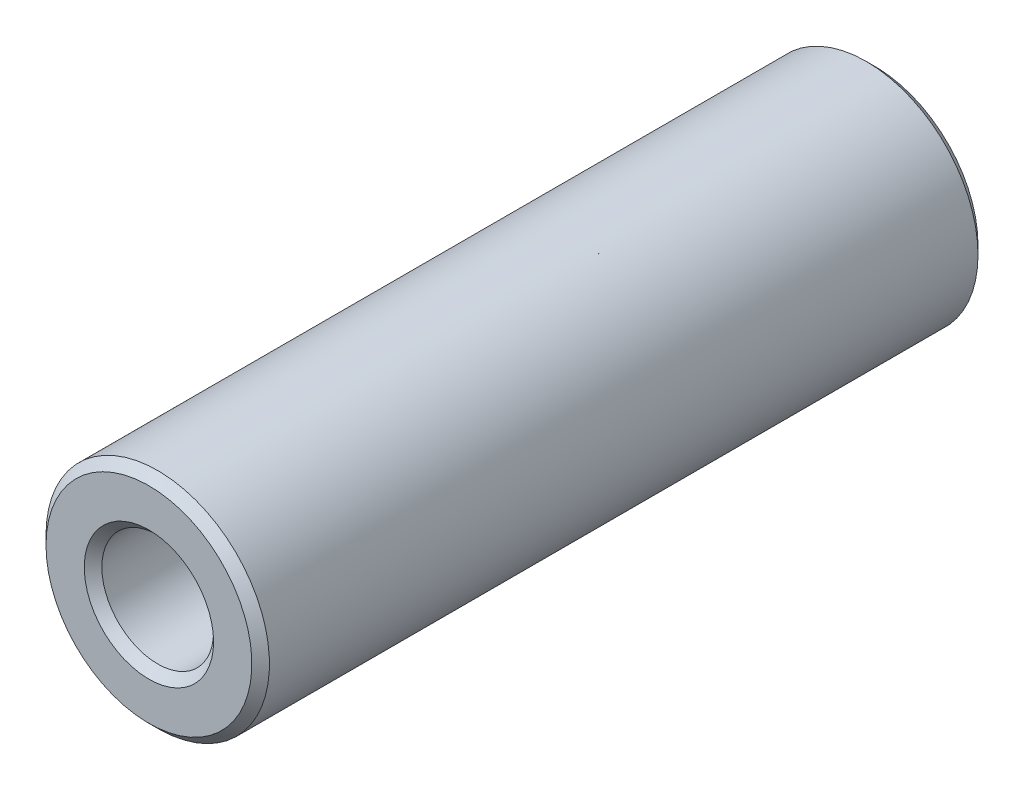
ISO-10303-21;
HEADER;
FILE_DESCRIPTION(('STEP AP214'),'2;1');
FILE_NAME('part.step','',(''),(''),'','','');
FILE_SCHEMA(('AUTOMOTIVE_DESIGN { 1 0 10303 214 1 1 1 1 }'));
ENDSEC;
DATA;
#1=APPLICATION_CONTEXT('core data for automotive mechanical design processes');
#2=APPLICATION_PROTOCOL_DEFINITION('international standard','automotive_design',2000,#1);
#3=PRODUCT_CONTEXT('',#1,'mechanical');
#4=PRODUCT('Part','Part','',(#3));
#5=PRODUCT_RELATED_PRODUCT_CATEGORY('part','',(#4));
#6=PRODUCT_DEFINITION_FORMATION('','',#4);
#7=PRODUCT_DEFINITION_CONTEXT('part definition',#1,'design');
#8=PRODUCT_DEFINITION('design','',#6,#7);
#9=PRODUCT_DEFINITION_SHAPE('','',#8);
#10=(LENGTH_UNIT() NAMED_UNIT(*) SI_UNIT(.MILLI.,.METRE.));
#11=(NAMED_UNIT(*) PLANE_ANGLE_UNIT() SI_UNIT($,.RADIAN.));
#12=(NAMED_UNIT(*) SI_UNIT($,.STERADIAN.) SOLID_ANGLE_UNIT());
#13=UNCERTAINTY_MEASURE_WITH_UNIT(LENGTH_MEASURE(1.E-05),#10,'distance_accuracy_value','');
#14=(GEOMETRIC_REPRESENTATION_CONTEXT(3) GLOBAL_UNCERTAINTY_ASSIGNED_CONTEXT((#13)) GLOBAL_UNIT_ASSIGNED_CONTEXT((#10,
#11,#12)) REPRESENTATION_CONTEXT('',''));
#15=CARTESIAN_POINT('',(0.,0.,0.));
#16=DIRECTION('',(0.,0.,1.));
#17=DIRECTION('',(1.,0.,0.));
#18=AXIS2_PLACEMENT_3D('',#15,#16,#17);
#19=CARTESIAN_POINT('',(0.,0.,41.275));
#20=DIRECTION('',(0.,0.,-1.));
#21=DIRECTION('',(-1.,0.,0.));
#22=AXIS2_PLACEMENT_3D('',#19,#20,#21);
#23=CYLINDRICAL_SURFACE('',#22,3.175);
#24=CARTESIAN_POINT('',(0.,0.,0.499999999988177));
#25=DIRECTION('',(0.,0.,-1.));
#26=DIRECTION('',(-1.,0.,0.));
#27=AXIS2_PLACEMENT_3D('',#24,#25,#26);
#28=CIRCLE('',#27,3.17499999999882);
#29=CARTESIAN_POINT('',(-3.17499999999882,0.,0.499999999988177));
#30=VERTEX_POINT('',#29);
#31=EDGE_CURVE('E29',#30,#30,#28,.T.);
#32=ORIENTED_EDGE('',*,*,#31,.T.);
#33=EDGE_LOOP('',(#32));
#34=FACE_BOUND('',#33,.T.);
#35=CARTESIAN_POINT('',(0.,0.,40.7750000000533));
#36=DIRECTION('',(0.,0.,1.));
#37=DIRECTION('',(1.,0.,0.));
#38=AXIS2_PLACEMENT_3D('',#35,#36,#37);
#39=CIRCLE('',#38,3.17500000005566);
#40=CARTESIAN_POINT('',(3.17500000005566,0.,40.7750000000533));
#41=VERTEX_POINT('',#40);
#42=EDGE_CURVE('E32',#41,#41,#39,.T.);
#43=ORIENTED_EDGE('',*,*,#42,.T.);
#44=EDGE_LOOP('',(#43));
#45=FACE_BOUND('',#44,.T.);
#46=ADVANCED_FACE('F14',(#34,#45),#23,.F.);
#47=CARTESIAN_POINT('',(0.,0.,41.2749999999278));
#48=DIRECTION('',(0.,0.,1.));
#49=DIRECTION('',(1.,0.,0.));
#50=AXIS2_PLACEMENT_3D('',#47,#48,#49);
#51=CONICAL_SURFACE('',#50,3.67499999987331,0.785398163397448);
#52=ORIENTED_EDGE('',*,*,#42,.F.);
#53=EDGE_LOOP('',(#52));
#54=FACE_BOUND('',#53,.T.);
#55=CARTESIAN_POINT('',(0.,0.,41.2749999999846));
#56=DIRECTION('',(0.,0.,1.));
#57=DIRECTION('',(1.,0.,0.));
#58=AXIS2_PLACEMENT_3D('',#55,#56,#57);
#59=CIRCLE('',#58,3.67499999993015);
#60=CARTESIAN_POINT('',(3.67499999993015,0.,41.2749999999846));
#61=VERTEX_POINT('',#60);
#62=EDGE_CURVE('E17',#61,#61,#59,.F.);
#63=ORIENTED_EDGE('',*,*,#62,.F.);
#64=EDGE_LOOP('',(#63));
#65=FACE_BOUND('',#64,.T.);
#66=ADVANCED_FACE('F49',(#54,#65),#51,.F.);
#67=CARTESIAN_POINT('',(0.,0.,5.6843418860808E-11));
#68=DIRECTION('',(0.,0.,-1.));
#69=DIRECTION('',(-1.,0.,0.));
#70=AXIS2_PLACEMENT_3D('',#67,#68,#69);
#71=CONICAL_SURFACE('',#70,3.67499999987331,0.785398163340605);
#72=CARTESIAN_POINT('',(0.,0.,0.));
#73=DIRECTION('',(0.,0.,-1.));
#74=DIRECTION('',(-1.,0.,0.));
#75=AXIS2_PLACEMENT_3D('',#72,#73,#74);
#76=CIRCLE('',#75,3.67499999993015);
#77=CARTESIAN_POINT('',(-3.67499999993015,0.,0.));
#78=VERTEX_POINT('',#77);
#79=EDGE_CURVE('E39',#78,#78,#76,.T.);
#80=ORIENTED_EDGE('',*,*,#79,.T.);
#81=EDGE_LOOP('',(#80));
#82=FACE_BOUND('',#81,.T.);
#83=ORIENTED_EDGE('',*,*,#31,.F.);
#84=EDGE_LOOP('',(#83));
#85=FACE_BOUND('',#84,.T.);
#86=ADVANCED_FACE('F51',(#82,#85),#71,.F.);
#87=CARTESIAN_POINT('',(0.,0.,41.275));
#88=DIRECTION('',(0.,0.,1.));
#89=DIRECTION('',(1.,0.,0.));
#90=AXIS2_PLACEMENT_3D('',#87,#88,#89);
#91=PLANE('',#90);
#92=ORIENTED_EDGE('',*,*,#62,.T.);
#93=EDGE_LOOP('',(#92));
#94=FACE_BOUND('',#93,.T.);
#95=CARTESIAN_POINT('',(0.,0.,41.2750000000415));
#96=DIRECTION('',(0.,0.,-1.));
#97=DIRECTION('',(-1.,0.,0.));
#98=AXIS2_PLACEMENT_3D('',#95,#96,#97);
#99=CIRCLE('',#98,5.85000000000946);
#100=CARTESIAN_POINT('',(-5.85000000000946,0.,41.2750000000415));
#101=VERTEX_POINT('',#100);
#102=EDGE_CURVE('E37',#101,#101,#99,.T.);
#103=ORIENTED_EDGE('',*,*,#102,.F.);
#104=EDGE_LOOP('',(#103));
#105=FACE_BOUND('',#104,.T.);
#106=ADVANCED_FACE('F46',(#94,#105),#91,.T.);
#107=CARTESIAN_POINT('',(0.,0.,0.));
#108=DIRECTION('',(0.,0.,1.));
#109=DIRECTION('',(1.,0.,0.));
#110=AXIS2_PLACEMENT_3D('',#107,#108,#109);
#111=PLANE('',#110);
#112=CARTESIAN_POINT('',(0.,0.,-5.6843418860808E-11));
#113=DIRECTION('',(0.,0.,1.));
#114=DIRECTION('',(1.,0.,0.));
#115=AXIS2_PLACEMENT_3D('',#112,#113,#114);
#116=CIRCLE('',#115,5.84999999995262);
#117=CARTESIAN_POINT('',(5.84999999995262,0.,-5.6843418860808E-11));
#118=VERTEX_POINT('',#117);
#119=EDGE_CURVE('E26',#118,#118,#116,.T.);
#120=ORIENTED_EDGE('',*,*,#119,.F.);
#121=EDGE_LOOP('',(#120));
#122=FACE_BOUND('',#121,.T.);
#123=ORIENTED_EDGE('',*,*,#79,.F.);
#124=EDGE_LOOP('',(#123));
#125=FACE_BOUND('',#124,.T.);
#126=ADVANCED_FACE('F76',(#122,#125),#111,.F.);
#127=CARTESIAN_POINT('',(0.,0.,40.7749999999396));
#128=DIRECTION('',(0.,0.,-1.));
#129=DIRECTION('',(-1.,0.,0.));
#130=AXIS2_PLACEMENT_3D('',#127,#128,#129);
#131=CONICAL_SURFACE('',#130,6.35000000005448,0.785398163340605);
#132=CARTESIAN_POINT('',(0.,0.,40.775));
#133=DIRECTION('',(0.,0.,-1.));
#134=DIRECTION('',(-1.,0.,0.));
#135=AXIS2_PLACEMENT_3D('',#132,#133,#134);
#136=CIRCLE('',#135,6.35);
#137=CARTESIAN_POINT('',(-6.35,0.,40.775));
#138=VERTEX_POINT('',#137);
#139=EDGE_CURVE('E21',#138,#138,#136,.T.);
#140=ORIENTED_EDGE('',*,*,#139,.F.);
#141=EDGE_LOOP('',(#140));
#142=FACE_BOUND('',#141,.T.);
#143=ORIENTED_EDGE('',*,*,#102,.T.);
#144=EDGE_LOOP('',(#143));
#145=FACE_BOUND('',#144,.T.);
#146=ADVANCED_FACE('F69',(#142,#145),#131,.T.);
#147=CARTESIAN_POINT('',(0.,0.,0.499999999931333));
#148=DIRECTION('',(0.,0.,1.));
#149=DIRECTION('',(1.,0.,0.));
#150=AXIS2_PLACEMENT_3D('',#147,#148,#149);
#151=CONICAL_SURFACE('',#150,6.34999999999764,0.785398163454292);
#152=CARTESIAN_POINT('',(0.,0.,0.499999999999994));
#153=DIRECTION('',(0.,0.,-1.));
#154=DIRECTION('',(-1.,0.,0.));
#155=AXIS2_PLACEMENT_3D('',#152,#153,#154);
#156=CIRCLE('',#155,6.35);
#157=CARTESIAN_POINT('',(-6.35,0.,0.499999999999994));
#158=VERTEX_POINT('',#157);
#159=EDGE_CURVE('E10',#158,#158,#156,.F.);
#160=ORIENTED_EDGE('',*,*,#159,.F.);
#161=EDGE_LOOP('',(#160));
#162=FACE_BOUND('',#161,.T.);
#163=ORIENTED_EDGE('',*,*,#119,.T.);
#164=EDGE_LOOP('',(#163));
#165=FACE_BOUND('',#164,.T.);
#166=ADVANCED_FACE('F64',(#162,#165),#151,.T.);
#167=CARTESIAN_POINT('',(0.,0.,41.275));
#168=DIRECTION('',(0.,0.,-1.));
#169=DIRECTION('',(-1.,0.,0.));
#170=AXIS2_PLACEMENT_3D('',#167,#168,#169);
#171=CYLINDRICAL_SURFACE('',#170,6.35);
#172=ORIENTED_EDGE('',*,*,#159,.T.);
#173=EDGE_LOOP('',(#172));
#174=FACE_BOUND('',#173,.T.);
#175=ORIENTED_EDGE('',*,*,#139,.T.);
#176=EDGE_LOOP('',(#175));
#177=FACE_BOUND('',#176,.T.);
#178=ADVANCED_FACE('F62',(#174,#177),#171,.T.);
#179=CLOSED_SHELL('',(#46,#66,#86,#106,#126,#146,#166,#178));
#180=MANIFOLD_SOLID_BREP('B1',#179);
#181=ADVANCED_BREP_SHAPE_REPRESENTATION('',(#18,#180),#14);
#182=SHAPE_DEFINITION_REPRESENTATION(#9,#181);
ENDSEC;
END-ISO-10303-21;
